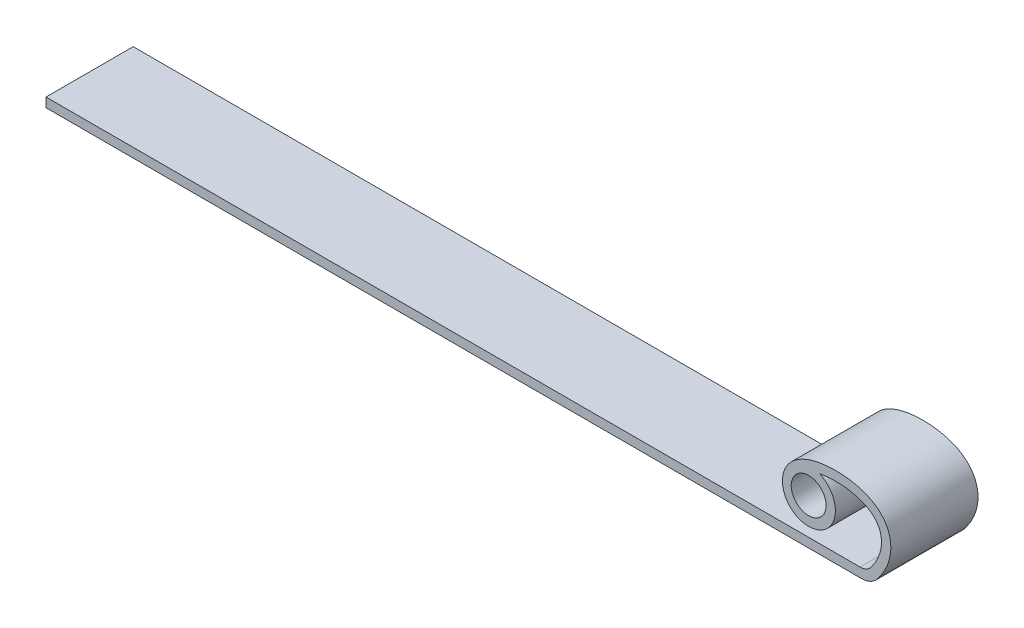
ISO-10303-21;
HEADER;
FILE_DESCRIPTION(('STEP AP214'),'2;1');
FILE_NAME('part.step','',(''),(''),'','','');
FILE_SCHEMA(('AUTOMOTIVE_DESIGN { 1 0 10303 214 1 1 1 1 }'));
ENDSEC;
DATA;
#1=APPLICATION_CONTEXT('core data for automotive mechanical design processes');
#2=APPLICATION_PROTOCOL_DEFINITION('international standard','automotive_design',2000,#1);
#3=PRODUCT_CONTEXT('',#1,'mechanical');
#4=PRODUCT('Part','Part','',(#3));
#5=PRODUCT_RELATED_PRODUCT_CATEGORY('part','',(#4));
#6=PRODUCT_DEFINITION_FORMATION('','',#4);
#7=PRODUCT_DEFINITION_CONTEXT('part definition',#1,'design');
#8=PRODUCT_DEFINITION('design','',#6,#7);
#9=PRODUCT_DEFINITION_SHAPE('','',#8);
#10=(LENGTH_UNIT() NAMED_UNIT(*) SI_UNIT(.MILLI.,.METRE.));
#11=(NAMED_UNIT(*) PLANE_ANGLE_UNIT() SI_UNIT($,.RADIAN.));
#12=(NAMED_UNIT(*) SI_UNIT($,.STERADIAN.) SOLID_ANGLE_UNIT());
#13=UNCERTAINTY_MEASURE_WITH_UNIT(LENGTH_MEASURE(1.E-05),#10,'distance_accuracy_value','');
#14=(GEOMETRIC_REPRESENTATION_CONTEXT(3) GLOBAL_UNCERTAINTY_ASSIGNED_CONTEXT((#13)) GLOBAL_UNIT_ASSIGNED_CONTEXT((#10,
#11,#12)) REPRESENTATION_CONTEXT('',''));
#15=CARTESIAN_POINT('',(0.,0.,0.));
#16=DIRECTION('',(0.,0.,1.));
#17=DIRECTION('',(1.,0.,0.));
#18=AXIS2_PLACEMENT_3D('',#15,#16,#17);
#19=CARTESIAN_POINT('',(0.,1.016,0.));
#20=DIRECTION('',(0.,-1.,0.));
#21=DIRECTION('',(0.,0.,-1.));
#22=AXIS2_PLACEMENT_3D('',#19,#20,#21);
#23=PLANE('',#22);
#24=DIRECTION('',(1.,0.,0.));
#25=VECTOR('',#24,1.);
#26=CARTESIAN_POINT('',(-63.5,1.016,4.7625));
#27=LINE('',#26,#25);
#28=CARTESIAN_POINT('',(-63.5,1.016,4.7625));
#29=VERTEX_POINT('',#28);
#30=CARTESIAN_POINT('',(25.4294916132884,1.016,4.7625));
#31=VERTEX_POINT('',#30);
#32=EDGE_CURVE('E130',#29,#31,#27,.T.);
#33=ORIENTED_EDGE('',*,*,#32,.T.);
#34=DIRECTION('',(0.,0.,-1.));
#35=VECTOR('',#34,1.);
#36=CARTESIAN_POINT('',(25.4294916132884,1.016,-4.7625));
#37=LINE('',#36,#35);
#38=CARTESIAN_POINT('',(25.4294916132884,1.016,-4.7625));
#39=VERTEX_POINT('',#38);
#40=EDGE_CURVE('E146',#31,#39,#37,.T.);
#41=ORIENTED_EDGE('',*,*,#40,.T.);
#42=DIRECTION('',(-1.,0.,0.));
#43=VECTOR('',#42,1.);
#44=CARTESIAN_POINT('',(-63.5,1.016,-4.7625));
#45=LINE('',#44,#43);
#46=CARTESIAN_POINT('',(-63.5,1.016,-4.7625));
#47=VERTEX_POINT('',#46);
#48=EDGE_CURVE('E126',#39,#47,#45,.T.);
#49=ORIENTED_EDGE('',*,*,#48,.T.);
#50=DIRECTION('',(0.,0.,1.));
#51=VECTOR('',#50,1.);
#52=CARTESIAN_POINT('',(-63.5,1.016,4.7625));
#53=LINE('',#52,#51);
#54=EDGE_CURVE('E128',#47,#29,#53,.T.);
#55=ORIENTED_EDGE('',*,*,#54,.T.);
#56=EDGE_LOOP('',(#33,#41,#49,#55));
#57=FACE_BOUND('',#56,.T.);
#58=ADVANCED_FACE('F36',(#57),#23,.F.);
#59=CARTESIAN_POINT('',(-63.5,1.016,-4.7625));
#60=DIRECTION('',(0.,0.,1.));
#61=DIRECTION('',(1.,0.,0.));
#62=AXIS2_PLACEMENT_3D('',#59,#60,#61);
#63=PLANE('',#62);
#64=CARTESIAN_POINT('',(26.9174009857066,0.342826159831232,-4.7625));
#65=CARTESIAN_POINT('',(27.1062709253508,0.556332001073155,-4.7625));
#66=CARTESIAN_POINT('',(27.475099892667,1.01221523242822,-4.7625));
#67=CARTESIAN_POINT('',(28.0556111375299,1.88634573641297,-4.7625));
#68=CARTESIAN_POINT('',(28.5577244190559,2.9622900851248,-4.7625));
#69=CARTESIAN_POINT('',(28.8172551996427,4.18061141059835,-4.7625));
#70=CARTESIAN_POINT('',(28.7604082601714,5.30661561008959,-4.7625));
#71=CARTESIAN_POINT('',(28.416603120646,6.29051182326088,-4.7625));
#72=CARTESIAN_POINT('',(27.6661810685899,7.34877057381525,-4.7625));
#73=CARTESIAN_POINT('',(26.4175511217383,8.17814256235725,-4.7625));
#74=CARTESIAN_POINT('',(24.8109210303498,8.66478827078927,-4.7625));
#75=CARTESIAN_POINT('',(22.9184859128989,8.87251485427046,-4.7625));
#76=CARTESIAN_POINT('',(21.3529959675459,8.76504204958954,-4.7625));
#77=CARTESIAN_POINT('',(19.4441640034384,8.31326815543713,-4.7625));
#78=CARTESIAN_POINT('',(17.9984943655162,7.53813343151065,-4.7625));
#79=CARTESIAN_POINT('',(17.0834155162083,6.10416322047196,-4.7625));
#80=CARTESIAN_POINT('',(16.8771571697637,4.94477470063637,-4.7625));
#81=CARTESIAN_POINT('',(17.0683568990603,3.92475217756166,-4.7625));
#82=CARTESIAN_POINT('',(17.4865560323122,3.16030331146307,-4.7625));
#83=CARTESIAN_POINT('',(17.8768333077936,2.76616341434722,-4.7625));
#84=CARTESIAN_POINT('',(18.1277480147528,2.57812608399675,-4.7625));
#85=CARTESIAN_POINT('',(18.1937607693303,2.53473190422722,-4.7625));
#86=CARTESIAN_POINT('',(18.2352294025315,2.5082795070323,-4.7625));
#87=B_SPLINE_CURVE_WITH_KNOTS('',3,(#64,#65,#66,#67,#68,#69,#70,#71,#72,#73,#74,#75,#76,#77,#78,
#79,#80,#81,#82,#83,#84,#85,#86),.UNSPECIFIED.,.F.,.F.,(4,1,1,1,1,1,1,1,1,1,1,1,1,1,1,1,1,1,1,1,
4),(0.,0.015625,0.03125,0.0625,0.09375,0.125,0.15625,0.1875,0.25,0.3125,0.375,0.469264357375816,
0.500514357375816,0.625,0.6875,0.75,0.8125,0.875,0.9375,0.96875,1.),.UNSPECIFIED.);
#88=CARTESIAN_POINT('',(27.4617146795305,1.016,-4.7625));
#89=VERTEX_POINT('',#88);
#90=CARTESIAN_POINT('',(18.2352294025315,2.50827950703232,-4.7625));
#91=VERTEX_POINT('',#90);
#92=EDGE_CURVE('E180',#89,#91,#87,.T.);
#93=ORIENTED_EDGE('',*,*,#92,.F.);
#94=CARTESIAN_POINT('',(25.5609527270464,2.286,-4.7625));
#95=DIRECTION('',(0.,0.,1.));
#96=DIRECTION('',(1.,0.,0.));
#97=AXIS2_PLACEMENT_3D('',#94,#95,#96);
#98=CIRCLE('',#97,2.286);
#99=CARTESIAN_POINT('',(25.5609527270464,0.,-4.7625));
#100=VERTEX_POINT('',#99);
#101=EDGE_CURVE('E12',#89,#100,#98,.F.);
#102=ORIENTED_EDGE('',*,*,#101,.T.);
#103=DIRECTION('',(-1.,0.,0.));
#104=VECTOR('',#103,1.);
#105=CARTESIAN_POINT('',(-63.5,0.,-4.7625));
#106=LINE('',#105,#104);
#107=CARTESIAN_POINT('',(-63.5,0.,-4.7625));
#108=VERTEX_POINT('',#107);
#109=EDGE_CURVE('E134',#100,#108,#106,.T.);
#110=ORIENTED_EDGE('',*,*,#109,.T.);
#111=DIRECTION('',(0.,-1.,0.));
#112=VECTOR('',#111,1.);
#113=CARTESIAN_POINT('',(-63.5,1.016,-4.7625));
#114=LINE('',#113,#112);
#115=EDGE_CURVE('E140',#47,#108,#114,.T.);
#116=ORIENTED_EDGE('',*,*,#115,.F.);
#117=ORIENTED_EDGE('',*,*,#48,.F.);
#118=CARTESIAN_POINT('',(25.4294916132884,2.54,-4.7625));
#119=DIRECTION('',(0.,0.,1.));
#120=DIRECTION('',(1.,0.,0.));
#121=AXIS2_PLACEMENT_3D('',#118,#119,#120);
#122=CIRCLE('',#121,1.524);
#123=CARTESIAN_POINT('',(26.661072965332,1.6423456270376,-4.7625));
#124=VERTEX_POINT('',#123);
#125=EDGE_CURVE('E150',#39,#124,#122,.T.);
#126=ORIENTED_EDGE('',*,*,#125,.T.);
#127=CARTESIAN_POINT('',(26.1564193953166,1.016,-4.7625));
#128=CARTESIAN_POINT('',(29.5475696325242,4.84948660743345,-4.7625));
#129=CARTESIAN_POINT('',(28.4151658443618,8.36313077854531,-4.7625));
#130=CARTESIAN_POINT('',(24.5268430225652,8.36765999835361,-4.7625));
#131=CARTESIAN_POINT('',(22.4635301221392,7.6076574974147,-4.7625));
#132=CARTESIAN_POINT('',(20.515419276567,8.56389233190752,-4.7625));
#133=CARTESIAN_POINT('',(16.3243438772082,8.19521426022341,-4.7625));
#134=CARTESIAN_POINT('',(17.2908874797024,4.62962491443218,-4.7625));
#135=CARTESIAN_POINT('',(17.9408873132131,3.94113729942767,-4.7625));
#136=CARTESIAN_POINT('',(18.5875887147073,3.48862065816186,-4.7625));
#137=CARTESIAN_POINT('',(18.781624736754,3.36484715686494,-4.7625));
#138=B_SPLINE_CURVE_WITH_KNOTS('',10,(#127,#128,#129,#130,#131,#132,#133,#134,#135,#136,#137),
.UNSPECIFIED.,.F.,.F.,(11,11),(0.,1.),.UNSPECIFIED.);
#139=CARTESIAN_POINT('',(21.0099513568341,7.63224978944858,-4.7625));
#140=VERTEX_POINT('',#139);
#141=EDGE_CURVE('E118',#124,#140,#138,.T.);
#142=ORIENTED_EDGE('',*,*,#141,.T.);
#143=CARTESIAN_POINT('',(19.8064193953166,4.97071793399283,-4.7625));
#144=DIRECTION('',(0.,0.,1.));
#145=DIRECTION('',(1.,0.,0.));
#146=AXIS2_PLACEMENT_3D('',#143,#144,#145);
#147=CIRCLE('',#146,2.92099999999998);
#148=EDGE_CURVE('E122',#91,#140,#147,.T.);
#149=ORIENTED_EDGE('',*,*,#148,.F.);
#150=EDGE_LOOP('',(#93,#102,#110,#116,#117,#126,#142,#149));
#151=FACE_BOUND('',#150,.T.);
#152=CARTESIAN_POINT('',(19.8064193953166,4.97071793399283,-4.7625));
#153=DIRECTION('',(0.,0.,1.));
#154=DIRECTION('',(1.,0.,0.));
#155=AXIS2_PLACEMENT_3D('',#152,#153,#154);
#156=CIRCLE('',#155,1.905);
#157=CARTESIAN_POINT('',(21.7114193953166,4.97071793399283,-4.7625));
#158=VERTEX_POINT('',#157);
#159=EDGE_CURVE('E177',#158,#158,#156,.T.);
#160=ORIENTED_EDGE('',*,*,#159,.T.);
#161=EDGE_LOOP('',(#160));
#162=FACE_BOUND('',#161,.T.);
#163=ADVANCED_FACE('F156',(#151,#162),#63,.F.);
#164=CARTESIAN_POINT('',(-63.5,1.016,4.7625));
#165=DIRECTION('',(1.,0.,0.));
#166=DIRECTION('',(0.,0.,-1.));
#167=AXIS2_PLACEMENT_3D('',#164,#165,#166);
#168=PLANE('',#167);
#169=DIRECTION('',(0.,0.,1.));
#170=VECTOR('',#169,1.);
#171=CARTESIAN_POINT('',(-63.5,0.,4.7625));
#172=LINE('',#171,#170);
#173=CARTESIAN_POINT('',(-63.5,0.,4.7625));
#174=VERTEX_POINT('',#173);
#175=EDGE_CURVE('E136',#108,#174,#172,.T.);
#176=ORIENTED_EDGE('',*,*,#175,.T.);
#177=DIRECTION('',(0.,-1.,0.));
#178=VECTOR('',#177,1.);
#179=CARTESIAN_POINT('',(-63.5,1.016,4.7625));
#180=LINE('',#179,#178);
#181=EDGE_CURVE('E133',#29,#174,#180,.T.);
#182=ORIENTED_EDGE('',*,*,#181,.F.);
#183=ORIENTED_EDGE('',*,*,#54,.F.);
#184=ORIENTED_EDGE('',*,*,#115,.T.);
#185=EDGE_LOOP('',(#176,#182,#183,#184));
#186=FACE_BOUND('',#185,.T.);
#187=ADVANCED_FACE('F161',(#186),#168,.F.);
#188=CARTESIAN_POINT('',(-63.5,1.016,4.7625));
#189=DIRECTION('',(0.,0.,-1.));
#190=DIRECTION('',(-1.,0.,0.));
#191=AXIS2_PLACEMENT_3D('',#188,#189,#190);
#192=PLANE('',#191);
#193=DIRECTION('',(1.,0.,0.));
#194=VECTOR('',#193,1.);
#195=CARTESIAN_POINT('',(-63.5,0.,4.7625));
#196=LINE('',#195,#194);
#197=CARTESIAN_POINT('',(25.5609527270464,0.,4.7625));
#198=VERTEX_POINT('',#197);
#199=EDGE_CURVE('E107',#174,#198,#196,.T.);
#200=ORIENTED_EDGE('',*,*,#199,.T.);
#201=CARTESIAN_POINT('',(25.5609527270464,2.286,4.7625));
#202=DIRECTION('',(0.,0.,-1.));
#203=DIRECTION('',(-1.,0.,0.));
#204=AXIS2_PLACEMENT_3D('',#201,#202,#203);
#205=CIRCLE('',#204,2.286);
#206=CARTESIAN_POINT('',(27.4617146795284,1.01600000000153,4.7625));
#207=VERTEX_POINT('',#206);
#208=EDGE_CURVE('E44',#198,#207,#205,.F.);
#209=ORIENTED_EDGE('',*,*,#208,.T.);
#210=CARTESIAN_POINT('',(26.9174009857066,0.342826159831232,4.7625));
#211=CARTESIAN_POINT('',(27.1062709253508,0.556332001073155,4.7625));
#212=CARTESIAN_POINT('',(27.475099892667,1.01221523242822,4.7625));
#213=CARTESIAN_POINT('',(28.0556111375299,1.88634573641297,4.7625));
#214=CARTESIAN_POINT('',(28.5577244190559,2.9622900851248,4.7625));
#215=CARTESIAN_POINT('',(28.8172551996427,4.18061141059835,4.7625));
#216=CARTESIAN_POINT('',(28.7604082601714,5.30661561008959,4.7625));
#217=CARTESIAN_POINT('',(28.416603120646,6.29051182326088,4.7625));
#218=CARTESIAN_POINT('',(27.6661810685899,7.34877057381525,4.7625));
#219=CARTESIAN_POINT('',(26.4175511217383,8.17814256235725,4.7625));
#220=CARTESIAN_POINT('',(24.8109210303498,8.66478827078927,4.7625));
#221=CARTESIAN_POINT('',(22.9184859128989,8.87251485427046,4.7625));
#222=CARTESIAN_POINT('',(21.3529959675459,8.76504204958954,4.7625));
#223=CARTESIAN_POINT('',(19.4441640034384,8.31326815543713,4.7625));
#224=CARTESIAN_POINT('',(17.9984943655162,7.53813343151065,4.7625));
#225=CARTESIAN_POINT('',(17.0834155162083,6.10416322047196,4.7625));
#226=CARTESIAN_POINT('',(16.8771571697637,4.94477470063637,4.7625));
#227=CARTESIAN_POINT('',(17.0683568990603,3.92475217756166,4.7625));
#228=CARTESIAN_POINT('',(17.4865560323122,3.16030331146307,4.7625));
#229=CARTESIAN_POINT('',(17.8768333077936,2.76616341434722,4.7625));
#230=CARTESIAN_POINT('',(18.1277480147528,2.57812608399675,4.7625));
#231=CARTESIAN_POINT('',(18.1937607693303,2.53473190422722,4.7625));
#232=CARTESIAN_POINT('',(18.2352294025315,2.5082795070323,4.7625));
#233=B_SPLINE_CURVE_WITH_KNOTS('',3,(#210,#211,#212,#213,#214,#215,#216,#217,#218,#219,#220,
#221,#222,#223,#224,#225,#226,#227,#228,#229,#230,#231,#232),.UNSPECIFIED.,.F.,.F.,(4,1,1,1,1,1,
1,1,1,1,1,1,1,1,1,1,1,1,1,1,4),(0.,0.015625,0.03125,0.0625,0.09375,0.125,0.15625,0.1875,0.25,
0.3125,0.375,0.469264357375816,0.500514357375816,0.625,0.6875,0.75,0.8125,0.875,0.9375,0.96875,
1.),.UNSPECIFIED.);
#234=CARTESIAN_POINT('',(18.2352294025315,2.50827950703232,4.7625));
#235=VERTEX_POINT('',#234);
#236=EDGE_CURVE('E104',#207,#235,#233,.T.);
#237=ORIENTED_EDGE('',*,*,#236,.T.);
#238=CARTESIAN_POINT('',(19.8064193953166,4.97071793399283,4.7625));
#239=DIRECTION('',(0.,0.,1.));
#240=DIRECTION('',(1.,0.,0.));
#241=AXIS2_PLACEMENT_3D('',#238,#239,#240);
#242=CIRCLE('',#241,2.92099999999998);
#243=CARTESIAN_POINT('',(21.0099513568341,7.63224978944858,4.7625));
#244=VERTEX_POINT('',#243);
#245=EDGE_CURVE('E115',#235,#244,#242,.T.);
#246=ORIENTED_EDGE('',*,*,#245,.T.);
#247=CARTESIAN_POINT('',(26.1564193953166,1.016,4.7625));
#248=CARTESIAN_POINT('',(29.5475696325242,4.84948660743345,4.7625));
#249=CARTESIAN_POINT('',(28.4151658443618,8.36313077854531,4.7625));
#250=CARTESIAN_POINT('',(24.5268430225652,8.36765999835361,4.7625));
#251=CARTESIAN_POINT('',(22.4635301221392,7.6076574974147,4.7625));
#252=CARTESIAN_POINT('',(20.515419276567,8.56389233190752,4.7625));
#253=CARTESIAN_POINT('',(16.3243438772082,8.19521426022341,4.7625));
#254=CARTESIAN_POINT('',(17.2908874797024,4.62962491443218,4.7625));
#255=CARTESIAN_POINT('',(17.9408873132131,3.94113729942767,4.7625));
#256=CARTESIAN_POINT('',(18.5875887147073,3.48862065816186,4.7625));
#257=CARTESIAN_POINT('',(18.781624736754,3.36484715686494,4.7625));
#258=B_SPLINE_CURVE_WITH_KNOTS('',10,(#247,#248,#249,#250,#251,#252,#253,#254,#255,#256,#257),
.UNSPECIFIED.,.F.,.F.,(11,11),(0.,1.),.UNSPECIFIED.);
#259=CARTESIAN_POINT('',(26.661072965332,1.6423456270376,4.7625));
#260=VERTEX_POINT('',#259);
#261=EDGE_CURVE('E175',#260,#244,#258,.T.);
#262=ORIENTED_EDGE('',*,*,#261,.F.);
#263=CARTESIAN_POINT('',(25.4294916132884,2.54,4.7625));
#264=DIRECTION('',(0.,0.,-1.));
#265=DIRECTION('',(-1.,0.,0.));
#266=AXIS2_PLACEMENT_3D('',#263,#264,#265);
#267=CIRCLE('',#266,1.524);
#268=EDGE_CURVE('E148',#260,#31,#267,.T.);
#269=ORIENTED_EDGE('',*,*,#268,.T.);
#270=ORIENTED_EDGE('',*,*,#32,.F.);
#271=ORIENTED_EDGE('',*,*,#181,.T.);
#272=EDGE_LOOP('',(#200,#209,#237,#246,#262,#269,#270,#271));
#273=FACE_BOUND('',#272,.T.);
#274=CARTESIAN_POINT('',(19.8064193953166,4.97071793399283,4.7625));
#275=DIRECTION('',(0.,0.,1.));
#276=DIRECTION('',(1.,0.,0.));
#277=AXIS2_PLACEMENT_3D('',#274,#275,#276);
#278=CIRCLE('',#277,1.905);
#279=CARTESIAN_POINT('',(21.7114193953166,4.97071793399283,4.7625));
#280=VERTEX_POINT('',#279);
#281=EDGE_CURVE('E116',#280,#280,#278,.T.);
#282=ORIENTED_EDGE('',*,*,#281,.F.);
#283=EDGE_LOOP('',(#282));
#284=FACE_BOUND('',#283,.T.);
#285=ADVANCED_FACE('F101',(#273,#284),#192,.F.);
#286=CARTESIAN_POINT('',(0.,0.,0.));
#287=DIRECTION('',(0.,-1.,0.));
#288=DIRECTION('',(0.,0.,-1.));
#289=AXIS2_PLACEMENT_3D('',#286,#287,#288);
#290=PLANE('',#289);
#291=ORIENTED_EDGE('',*,*,#109,.F.);
#292=DIRECTION('',(0.,0.,-1.));
#293=VECTOR('',#292,1.);
#294=CARTESIAN_POINT('',(25.5609527270464,0.,4.7625));
#295=LINE('',#294,#293);
#296=EDGE_CURVE('E108',#100,#198,#295,.F.);
#297=ORIENTED_EDGE('',*,*,#296,.T.);
#298=ORIENTED_EDGE('',*,*,#199,.F.);
#299=ORIENTED_EDGE('',*,*,#175,.F.);
#300=EDGE_LOOP('',(#291,#297,#298,#299));
#301=FACE_BOUND('',#300,.T.);
#302=ADVANCED_FACE('F153',(#301),#290,.T.);
#303=DIRECTION('',(0.,0.,1.));
#304=VECTOR('',#303,1.);
#305=SURFACE_OF_LINEAR_EXTRUSION('',#138,#304);
#306=ORIENTED_EDGE('',*,*,#141,.F.);
#307=DIRECTION('',(0.,0.,1.));
#308=VECTOR('',#307,1.);
#309=CARTESIAN_POINT('',(26.661072965332,1.64234562703764,-4.76250000000001));
#310=LINE('',#309,#308);
#311=EDGE_CURVE('E143',#124,#260,#310,.T.);
#312=ORIENTED_EDGE('',*,*,#311,.T.);
#313=ORIENTED_EDGE('',*,*,#261,.T.);
#314=DIRECTION('',(0.,0.,1.));
#315=VECTOR('',#314,1.);
#316=CARTESIAN_POINT('',(21.0099513568341,7.63224978944858,-4.7625));
#317=LINE('',#316,#315);
#318=EDGE_CURVE('E120',#140,#244,#317,.T.);
#319=ORIENTED_EDGE('',*,*,#318,.F.);
#320=EDGE_LOOP('',(#306,#312,#313,#319));
#321=FACE_BOUND('',#320,.T.);
#322=ADVANCED_FACE('F173',(#321),#305,.F.);
#323=CARTESIAN_POINT('',(19.8064193953166,4.97071793399283,-4.7625));
#324=DIRECTION('',(0.,0.,1.));
#325=DIRECTION('',(1.,0.,0.));
#326=AXIS2_PLACEMENT_3D('',#323,#324,#325);
#327=CYLINDRICAL_SURFACE('',#326,2.92099999999998);
#328=ORIENTED_EDGE('',*,*,#245,.F.);
#329=DIRECTION('',(0.,0.,1.));
#330=VECTOR('',#329,1.);
#331=CARTESIAN_POINT('',(18.2352294025315,2.50827950703232,-4.7625));
#332=LINE('',#331,#330);
#333=EDGE_CURVE('E113',#91,#235,#332,.T.);
#334=ORIENTED_EDGE('',*,*,#333,.F.);
#335=ORIENTED_EDGE('',*,*,#148,.T.);
#336=ORIENTED_EDGE('',*,*,#318,.T.);
#337=EDGE_LOOP('',(#328,#334,#335,#336));
#338=FACE_BOUND('',#337,.T.);
#339=ADVANCED_FACE('F190',(#338),#327,.T.);
#340=CARTESIAN_POINT('',(19.8064193953166,4.97071793399283,-4.7625));
#341=DIRECTION('',(0.,0.,1.));
#342=DIRECTION('',(1.,0.,0.));
#343=AXIS2_PLACEMENT_3D('',#340,#341,#342);
#344=CYLINDRICAL_SURFACE('',#343,1.905);
#345=CARTESIAN_POINT('',(21.7114193953166,4.97071793399283,-4.7625));
#346=CARTESIAN_POINT('',(21.7114193953166,4.97071793399283,-4.66328125));
#347=CARTESIAN_POINT('',(21.7114193953166,4.97071793399283,-4.5640625));
#348=CARTESIAN_POINT('',(21.7114193953166,4.97071793399283,-4.365625));
#349=CARTESIAN_POINT('',(21.7114193953166,4.97071793399283,-4.26640625));
#350=CARTESIAN_POINT('',(21.7114193953166,4.97071793399283,-4.06796875));
#351=CARTESIAN_POINT('',(21.7114193953166,4.97071793399283,-3.96875));
#352=CARTESIAN_POINT('',(21.7114193953166,4.97071793399283,-3.7703125));
#353=CARTESIAN_POINT('',(21.7114193953166,4.97071793399283,-3.67109375));
#354=CARTESIAN_POINT('',(21.7114193953166,4.97071793399283,-3.47265625));
#355=CARTESIAN_POINT('',(21.7114193953166,4.97071793399283,-3.3734375));
#356=CARTESIAN_POINT('',(21.7114193953166,4.97071793399283,-3.175));
#357=CARTESIAN_POINT('',(21.7114193953166,4.97071793399283,-3.07578125));
#358=CARTESIAN_POINT('',(21.7114193953166,4.97071793399283,-2.87734375));
#359=CARTESIAN_POINT('',(21.7114193953166,4.97071793399283,-2.778125));
#360=CARTESIAN_POINT('',(21.7114193953166,4.97071793399283,-2.5796875));
#361=CARTESIAN_POINT('',(21.7114193953166,4.97071793399283,-2.48046875));
#362=CARTESIAN_POINT('',(21.7114193953166,4.97071793399283,-2.28203125));
#363=CARTESIAN_POINT('',(21.7114193953166,4.97071793399283,-2.1828125));
#364=CARTESIAN_POINT('',(21.7114193953166,4.97071793399283,-1.984375));
#365=CARTESIAN_POINT('',(21.7114193953166,4.97071793399283,-1.88515625));
#366=CARTESIAN_POINT('',(21.7114193953166,4.97071793399283,-1.68671875));
#367=CARTESIAN_POINT('',(21.7114193953166,4.97071793399283,-1.5875));
#368=CARTESIAN_POINT('',(21.7114193953166,4.97071793399283,-1.3890625));
#369=CARTESIAN_POINT('',(21.7114193953166,4.97071793399283,-1.28984375));
#370=CARTESIAN_POINT('',(21.7114193953166,4.97071793399283,-1.09140625));
#371=CARTESIAN_POINT('',(21.7114193953166,4.97071793399283,-0.9921875));
#372=CARTESIAN_POINT('',(21.7114193953166,4.97071793399283,-0.79375));
#373=CARTESIAN_POINT('',(21.7114193953166,4.97071793399283,-0.69453125));
#374=CARTESIAN_POINT('',(21.7114193953166,4.97071793399283,-0.49609375));
#375=CARTESIAN_POINT('',(21.7114193953166,4.97071793399283,-0.396875));
#376=CARTESIAN_POINT('',(21.7114193953166,4.97071793399283,-0.1984375));
#377=CARTESIAN_POINT('',(21.7114193953166,4.97071793399283,-0.0992187500000001));
#378=CARTESIAN_POINT('',(21.7114193953166,4.97071793399283,0.0992187500000001));
#379=CARTESIAN_POINT('',(21.7114193953166,4.97071793399283,0.1984375));
#380=CARTESIAN_POINT('',(21.7114193953166,4.97071793399283,0.396875));
#381=CARTESIAN_POINT('',(21.7114193953166,4.97071793399283,0.49609375));
#382=CARTESIAN_POINT('',(21.7114193953166,4.97071793399283,0.69453125));
#383=CARTESIAN_POINT('',(21.7114193953166,4.97071793399283,0.793750000000001));
#384=CARTESIAN_POINT('',(21.7114193953166,4.97071793399283,0.992187500000001));
#385=CARTESIAN_POINT('',(21.7114193953166,4.97071793399283,1.09140625));
#386=CARTESIAN_POINT('',(21.7114193953166,4.97071793399283,1.28984375));
#387=CARTESIAN_POINT('',(21.7114193953166,4.97071793399283,1.3890625));
#388=CARTESIAN_POINT('',(21.7114193953166,4.97071793399283,1.5875));
#389=CARTESIAN_POINT('',(21.7114193953166,4.97071793399283,1.68671875));
#390=CARTESIAN_POINT('',(21.7114193953166,4.97071793399283,1.88515625));
#391=CARTESIAN_POINT('',(21.7114193953166,4.97071793399283,1.984375));
#392=CARTESIAN_POINT('',(21.7114193953166,4.97071793399283,2.1828125));
#393=CARTESIAN_POINT('',(21.7114193953166,4.97071793399283,2.28203125));
#394=CARTESIAN_POINT('',(21.7114193953166,4.97071793399283,2.48046875));
#395=CARTESIAN_POINT('',(21.7114193953166,4.97071793399283,2.5796875));
#396=CARTESIAN_POINT('',(21.7114193953166,4.97071793399283,2.778125));
#397=CARTESIAN_POINT('',(21.7114193953166,4.97071793399283,2.87734375));
#398=CARTESIAN_POINT('',(21.7114193953166,4.97071793399283,3.07578125));
#399=CARTESIAN_POINT('',(21.7114193953166,4.97071793399283,3.175));
#400=CARTESIAN_POINT('',(21.7114193953166,4.97071793399283,3.3734375));
#401=CARTESIAN_POINT('',(21.7114193953166,4.97071793399283,3.47265625));
#402=CARTESIAN_POINT('',(21.7114193953166,4.97071793399283,3.67109375));
#403=CARTESIAN_POINT('',(21.7114193953166,4.97071793399283,3.7703125));
#404=CARTESIAN_POINT('',(21.7114193953166,4.97071793399283,3.96875));
#405=CARTESIAN_POINT('',(21.7114193953166,4.97071793399283,4.06796875));
#406=CARTESIAN_POINT('',(21.7114193953166,4.97071793399283,4.26640625));
#407=CARTESIAN_POINT('',(21.7114193953166,4.97071793399283,4.365625));
#408=CARTESIAN_POINT('',(21.7114193953166,4.97071793399283,4.5640625));
#409=CARTESIAN_POINT('',(21.7114193953166,4.97071793399283,4.66328125));
#410=CARTESIAN_POINT('',(21.7114193953166,4.97071793399283,4.7625));
#411=B_SPLINE_CURVE_WITH_KNOTS('',3,(#345,#346,#347,#348,#349,#350,#351,#352,#353,#354,#355,
#356,#357,#358,#359,#360,#361,#362,#363,#364,#365,#366,#367,#368,#369,#370,#371,#372,#373,#374,
#375,#376,#377,#378,#379,#380,#381,#382,#383,#384,#385,#386,#387,#388,#389,#390,#391,#392,#393,
#394,#395,#396,#397,#398,#399,#400,#401,#402,#403,#404,#405,#406,#407,#408,#409,#410),
.UNSPECIFIED.,.F.,.F.,(4,2,2,2,2,2,2,2,2,2,2,2,2,2,2,2,2,2,2,2,2,2,2,2,2,2,2,2,2,2,2,2,4),(0.,
0.297656249999999,0.595312499999999,0.89296875,1.190625,1.48828125,1.7859375,2.08359375,2.38125,
2.67890625,2.9765625,3.27421875,3.571875,3.86953125,4.1671875,4.46484375,4.7625,5.06015625,
5.3578125,5.65546875,5.953125,6.25078125,6.5484375,6.84609375,7.14375,7.44140625,7.7390625,
8.03671875,8.334375,8.63203125,8.9296875,9.22734375,9.525),.UNSPECIFIED.);
#412=EDGE_CURVE('BSEAM209',#158,#280,#411,.T.);
#413=ORIENTED_EDGE('',*,*,#159,.F.);
#414=ORIENTED_EDGE('',*,*,#281,.T.);
#415=ORIENTED_EDGE('',*,*,#412,.T.);
#416=ORIENTED_EDGE('',*,*,#412,.F.);
#417=EDGE_LOOP('',(#413,#415,#414,#416));
#418=FACE_BOUND('',#417,.T.);
#419=ADVANCED_FACE('F209',(#418),#344,.F.);
#420=DIRECTION('',(0.,0.,1.));
#421=VECTOR('',#420,1.);
#422=SURFACE_OF_LINEAR_EXTRUSION('',#87,#421);
#423=ORIENTED_EDGE('',*,*,#236,.F.);
#424=DIRECTION('',(0.,0.,1.));
#425=VECTOR('',#424,1.);
#426=CARTESIAN_POINT('',(27.4617146795305,1.016,-4.7625));
#427=LINE('',#426,#425);
#428=EDGE_CURVE('E112',#89,#207,#427,.T.);
#429=ORIENTED_EDGE('',*,*,#428,.F.);
#430=ORIENTED_EDGE('',*,*,#92,.T.);
#431=ORIENTED_EDGE('',*,*,#333,.T.);
#432=EDGE_LOOP('',(#423,#429,#430,#431));
#433=FACE_BOUND('',#432,.T.);
#434=ADVANCED_FACE('F110',(#433),#422,.T.);
#435=CARTESIAN_POINT('',(25.4294916132884,2.54,0.));
#436=DIRECTION('',(0.,0.,1.));
#437=DIRECTION('',(1.,0.,0.));
#438=AXIS2_PLACEMENT_3D('',#435,#436,#437);
#439=CYLINDRICAL_SURFACE('',#438,1.524);
#440=ORIENTED_EDGE('',*,*,#125,.F.);
#441=ORIENTED_EDGE('',*,*,#40,.F.);
#442=ORIENTED_EDGE('',*,*,#268,.F.);
#443=ORIENTED_EDGE('',*,*,#311,.F.);
#444=EDGE_LOOP('',(#440,#441,#442,#443));
#445=FACE_BOUND('',#444,.T.);
#446=ADVANCED_FACE('F170',(#445),#439,.F.);
#447=CARTESIAN_POINT('',(25.5609527270464,2.286,0.));
#448=DIRECTION('',(0.,0.,1.));
#449=DIRECTION('',(1.,0.,0.));
#450=AXIS2_PLACEMENT_3D('',#447,#448,#449);
#451=CYLINDRICAL_SURFACE('',#450,2.286);
#452=ORIENTED_EDGE('',*,*,#101,.F.);
#453=ORIENTED_EDGE('',*,*,#428,.T.);
#454=ORIENTED_EDGE('',*,*,#208,.F.);
#455=ORIENTED_EDGE('',*,*,#296,.F.);
#456=EDGE_LOOP('',(#452,#453,#454,#455));
#457=FACE_BOUND('',#456,.T.);
#458=ADVANCED_FACE('F38',(#457),#451,.T.);
#459=CLOSED_SHELL('',(#58,#163,#187,#285,#302,#322,#339,#419,#434,#446,#458));
#460=MANIFOLD_SOLID_BREP('B2',#459);
#461=ADVANCED_BREP_SHAPE_REPRESENTATION('',(#18,#460),#14);
#462=SHAPE_DEFINITION_REPRESENTATION(#9,#461);
ENDSEC;
END-ISO-10303-21;
